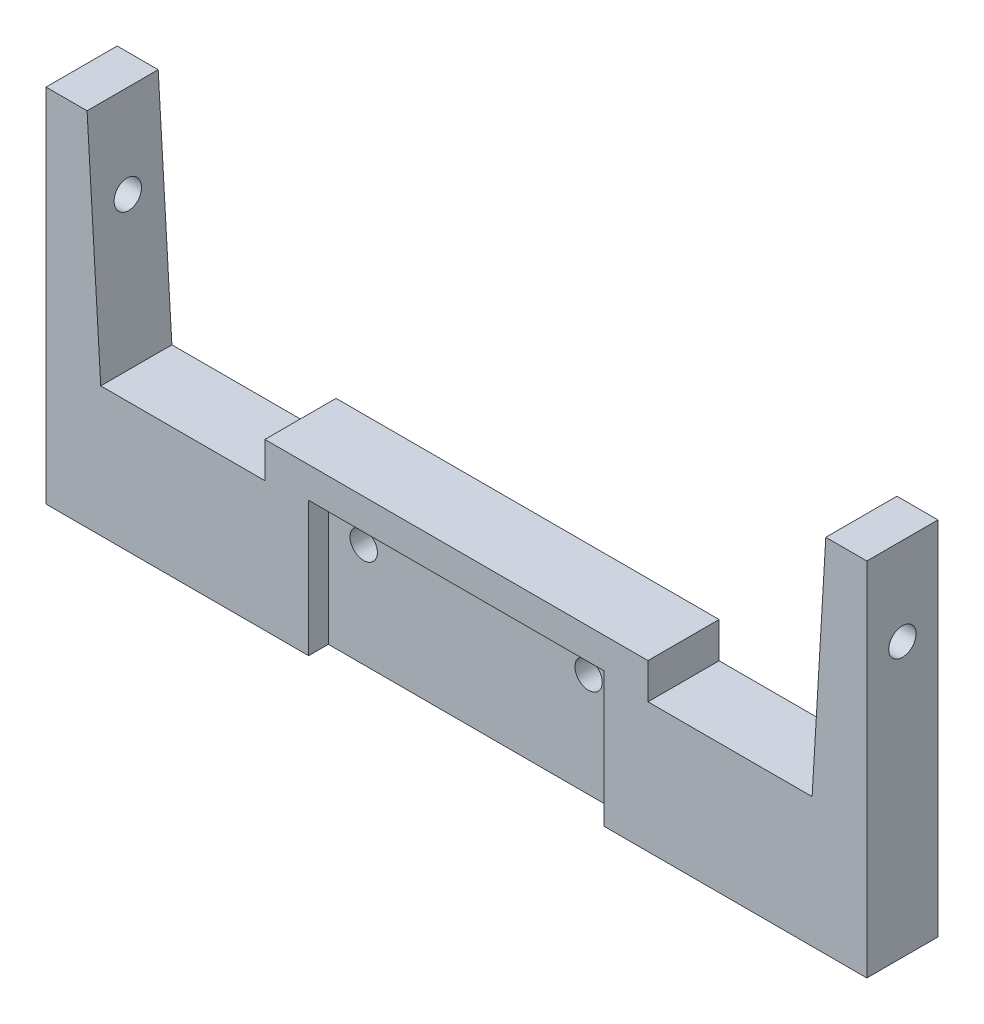
ISO-10303-21;
HEADER;
FILE_DESCRIPTION(('STEP AP214'),'2;1');
FILE_NAME('part.step','',(''),(''),'','','');
FILE_SCHEMA(('AUTOMOTIVE_DESIGN { 1 0 10303 214 1 1 1 1 }'));
ENDSEC;
DATA;
#1=APPLICATION_CONTEXT('core data for automotive mechanical design processes');
#2=APPLICATION_PROTOCOL_DEFINITION('international standard','automotive_design',2000,#1);
#3=PRODUCT_CONTEXT('',#1,'mechanical');
#4=PRODUCT('Part','Part','',(#3));
#5=PRODUCT_RELATED_PRODUCT_CATEGORY('part','',(#4));
#6=PRODUCT_DEFINITION_FORMATION('','',#4);
#7=PRODUCT_DEFINITION_CONTEXT('part definition',#1,'design');
#8=PRODUCT_DEFINITION('design','',#6,#7);
#9=PRODUCT_DEFINITION_SHAPE('','',#8);
#10=(LENGTH_UNIT() NAMED_UNIT(*) SI_UNIT(.MILLI.,.METRE.));
#11=(NAMED_UNIT(*) PLANE_ANGLE_UNIT() SI_UNIT($,.RADIAN.));
#12=(NAMED_UNIT(*) SI_UNIT($,.STERADIAN.) SOLID_ANGLE_UNIT());
#13=UNCERTAINTY_MEASURE_WITH_UNIT(LENGTH_MEASURE(1.E-05),#10,'distance_accuracy_value','');
#14=(GEOMETRIC_REPRESENTATION_CONTEXT(3) GLOBAL_UNCERTAINTY_ASSIGNED_CONTEXT((#13)) GLOBAL_UNIT_ASSIGNED_CONTEXT((#10,
#11,#12)) REPRESENTATION_CONTEXT('',''));
#15=CARTESIAN_POINT('',(0.,0.,0.));
#16=DIRECTION('',(0.,0.,1.));
#17=DIRECTION('',(1.,0.,0.));
#18=AXIS2_PLACEMENT_3D('',#15,#16,#17);
#19=CARTESIAN_POINT('',(47.775,9.5,0.));
#20=DIRECTION('',(0.,0.,1.));
#21=DIRECTION('',(1.,0.,0.));
#22=AXIS2_PLACEMENT_3D('',#19,#20,#21);
#23=CYLINDRICAL_SURFACE('',#22,1.25);
#24=CARTESIAN_POINT('',(47.775,9.5,2.5));
#25=DIRECTION('',(0.,0.,-1.));
#26=DIRECTION('',(-1.,0.,0.));
#27=AXIS2_PLACEMENT_3D('',#24,#25,#26);
#28=CIRCLE('',#27,1.25);
#29=CARTESIAN_POINT('',(46.525,9.5,2.5));
#30=VERTEX_POINT('',#29);
#31=EDGE_CURVE('E290',#30,#30,#28,.T.);
#32=ORIENTED_EDGE('',*,*,#31,.T.);
#33=EDGE_LOOP('',(#32));
#34=FACE_BOUND('',#33,.T.);
#35=CARTESIAN_POINT('',(47.775,9.5,4.7));
#36=DIRECTION('',(0.,0.,1.));
#37=DIRECTION('',(1.,0.,0.));
#38=AXIS2_PLACEMENT_3D('',#35,#36,#37);
#39=CIRCLE('',#38,1.25);
#40=CARTESIAN_POINT('',(49.025,9.5,4.7));
#41=VERTEX_POINT('',#40);
#42=EDGE_CURVE('E286',#41,#41,#39,.F.);
#43=ORIENTED_EDGE('',*,*,#42,.F.);
#44=EDGE_LOOP('',(#43));
#45=FACE_BOUND('',#44,.T.);
#46=ADVANCED_FACE('F45',(#34,#45),#23,.F.);
#47=CARTESIAN_POINT('',(27.225,9.5,0.));
#48=DIRECTION('',(0.,0.,1.));
#49=DIRECTION('',(1.,0.,0.));
#50=AXIS2_PLACEMENT_3D('',#47,#48,#49);
#51=CYLINDRICAL_SURFACE('',#50,1.25);
#52=CARTESIAN_POINT('',(27.225,9.5,2.5));
#53=DIRECTION('',(0.,0.,-1.));
#54=DIRECTION('',(-1.,0.,0.));
#55=AXIS2_PLACEMENT_3D('',#52,#53,#54);
#56=CIRCLE('',#55,1.25);
#57=CARTESIAN_POINT('',(25.975,9.5,2.5));
#58=VERTEX_POINT('',#57);
#59=EDGE_CURVE('E377',#58,#58,#56,.T.);
#60=ORIENTED_EDGE('',*,*,#59,.T.);
#61=EDGE_LOOP('',(#60));
#62=FACE_BOUND('',#61,.T.);
#63=CARTESIAN_POINT('',(27.225,9.5,4.7));
#64=DIRECTION('',(0.,0.,1.));
#65=DIRECTION('',(1.,0.,0.));
#66=AXIS2_PLACEMENT_3D('',#63,#64,#65);
#67=CIRCLE('',#66,1.25);
#68=CARTESIAN_POINT('',(28.475,9.5,4.7));
#69=VERTEX_POINT('',#68);
#70=EDGE_CURVE('E280',#69,#69,#67,.F.);
#71=ORIENTED_EDGE('',*,*,#70,.F.);
#72=EDGE_LOOP('',(#71));
#73=FACE_BOUND('',#72,.T.);
#74=ADVANCED_FACE('F550',(#62,#73),#51,.F.);
#75=CARTESIAN_POINT('',(0.,33.,6.5));
#76=DIRECTION('',(1.,0.,0.));
#77=DIRECTION('',(0.,0.,-1.));
#78=AXIS2_PLACEMENT_3D('',#75,#76,#77);
#79=PLANE('',#78);
#80=CARTESIAN_POINT('',(0.,25.,3.25));
#81=DIRECTION('',(-1.,0.,0.));
#82=DIRECTION('',(0.,0.,1.));
#83=AXIS2_PLACEMENT_3D('',#80,#81,#82);
#84=CIRCLE('',#83,1.25);
#85=CARTESIAN_POINT('',(0.,25.,4.5));
#86=VERTEX_POINT('',#85);
#87=EDGE_CURVE('E907',#86,#86,#84,.T.);
#88=ORIENTED_EDGE('',*,*,#87,.F.);
#89=EDGE_LOOP('',(#88));
#90=FACE_BOUND('',#89,.T.);
#91=DIRECTION('',(0.,-1.,0.));
#92=VECTOR('',#91,1.);
#93=CARTESIAN_POINT('',(0.,33.,0.));
#94=LINE('',#93,#92);
#95=CARTESIAN_POINT('',(0.,33.,0.));
#96=VERTEX_POINT('',#95);
#97=CARTESIAN_POINT('',(0.,0.,0.));
#98=VERTEX_POINT('',#97);
#99=EDGE_CURVE('E342',#96,#98,#94,.T.);
#100=ORIENTED_EDGE('',*,*,#99,.T.);
#101=DIRECTION('',(0.,0.,-1.));
#102=VECTOR('',#101,1.);
#103=CARTESIAN_POINT('',(0.,0.,6.5));
#104=LINE('',#103,#102);
#105=CARTESIAN_POINT('',(0.,0.,6.5));
#106=VERTEX_POINT('',#105);
#107=EDGE_CURVE('E11',#106,#98,#104,.T.);
#108=ORIENTED_EDGE('',*,*,#107,.F.);
#109=DIRECTION('',(0.,-1.,0.));
#110=VECTOR('',#109,1.);
#111=CARTESIAN_POINT('',(0.,33.,6.5));
#112=LINE('',#111,#110);
#113=CARTESIAN_POINT('',(0.,33.,6.5));
#114=VERTEX_POINT('',#113);
#115=EDGE_CURVE('E423',#114,#106,#112,.T.);
#116=ORIENTED_EDGE('',*,*,#115,.F.);
#117=DIRECTION('',(0.,0.,-1.));
#118=VECTOR('',#117,1.);
#119=CARTESIAN_POINT('',(0.,33.,6.5));
#120=LINE('',#119,#118);
#121=EDGE_CURVE('E462',#114,#96,#120,.T.);
#122=ORIENTED_EDGE('',*,*,#121,.T.);
#123=EDGE_LOOP('',(#100,#108,#116,#122));
#124=FACE_BOUND('',#123,.T.);
#125=ADVANCED_FACE('F47',(#90,#124),#79,.F.);
#126=CARTESIAN_POINT('',(0.,0.,6.5));
#127=DIRECTION('',(0.,1.,0.));
#128=DIRECTION('',(0.,0.,1.));
#129=AXIS2_PLACEMENT_3D('',#126,#127,#128);
#130=PLANE('',#129);
#131=DIRECTION('',(1.,0.,0.));
#132=VECTOR('',#131,1.);
#133=CARTESIAN_POINT('',(23.9966837443902,0.,4.7));
#134=LINE('',#133,#132);
#135=CARTESIAN_POINT('',(23.9966837443902,0.,4.7));
#136=VERTEX_POINT('',#135);
#137=CARTESIAN_POINT('',(50.9966837443902,0.,4.7));
#138=VERTEX_POINT('',#137);
#139=EDGE_CURVE('E252',#136,#138,#134,.T.);
#140=ORIENTED_EDGE('',*,*,#139,.F.);
#141=DIRECTION('',(0.,0.,1.));
#142=VECTOR('',#141,1.);
#143=CARTESIAN_POINT('',(23.9966837443902,0.,4.7));
#144=LINE('',#143,#142);
#145=CARTESIAN_POINT('',(23.9966837443902,0.,6.5));
#146=VERTEX_POINT('',#145);
#147=EDGE_CURVE('E234',#136,#146,#144,.T.);
#148=ORIENTED_EDGE('',*,*,#147,.T.);
#149=DIRECTION('',(1.,0.,0.));
#150=VECTOR('',#149,1.);
#151=CARTESIAN_POINT('',(0.,0.,6.5));
#152=LINE('',#151,#150);
#153=EDGE_CURVE('E429',#106,#146,#152,.T.);
#154=ORIENTED_EDGE('',*,*,#153,.F.);
#155=ORIENTED_EDGE('',*,*,#107,.T.);
#156=DIRECTION('',(1.,0.,0.));
#157=VECTOR('',#156,1.);
#158=CARTESIAN_POINT('',(0.,0.,0.));
#159=LINE('',#158,#157);
#160=CARTESIAN_POINT('',(75.,0.,0.));
#161=VERTEX_POINT('',#160);
#162=EDGE_CURVE('E466',#98,#161,#159,.T.);
#163=ORIENTED_EDGE('',*,*,#162,.T.);
#164=DIRECTION('',(0.,0.,-1.));
#165=VECTOR('',#164,1.);
#166=CARTESIAN_POINT('',(75.,0.,6.5));
#167=LINE('',#166,#165);
#168=CARTESIAN_POINT('',(75.,0.,6.5));
#169=VERTEX_POINT('',#168);
#170=EDGE_CURVE('E55',#169,#161,#167,.T.);
#171=ORIENTED_EDGE('',*,*,#170,.F.);
#172=CARTESIAN_POINT('',(50.9966837443902,0.,6.5));
#173=VERTEX_POINT('',#172);
#174=EDGE_CURVE('E427',#173,#169,#152,.T.);
#175=ORIENTED_EDGE('',*,*,#174,.F.);
#176=DIRECTION('',(0.,0.,1.));
#177=VECTOR('',#176,1.);
#178=CARTESIAN_POINT('',(50.9966837443902,0.,4.7));
#179=LINE('',#178,#177);
#180=EDGE_CURVE('E63',#138,#173,#179,.T.);
#181=ORIENTED_EDGE('',*,*,#180,.F.);
#182=EDGE_LOOP('',(#140,#148,#154,#155,#163,#171,#175,#181));
#183=FACE_BOUND('',#182,.T.);
#184=ADVANCED_FACE('F257',(#183),#130,.F.);
#185=CARTESIAN_POINT('',(75.,0.,6.5));
#186=DIRECTION('',(-1.,0.,0.));
#187=DIRECTION('',(0.,0.,1.));
#188=AXIS2_PLACEMENT_3D('',#185,#186,#187);
#189=PLANE('',#188);
#190=CARTESIAN_POINT('',(75.,25.,3.25));
#191=DIRECTION('',(-1.,0.,0.));
#192=DIRECTION('',(0.,0.,1.));
#193=AXIS2_PLACEMENT_3D('',#190,#191,#192);
#194=CIRCLE('',#193,1.25);
#195=CARTESIAN_POINT('',(75.,25.,4.5));
#196=VERTEX_POINT('',#195);
#197=EDGE_CURVE('E900',#196,#196,#194,.T.);
#198=ORIENTED_EDGE('',*,*,#197,.T.);
#199=EDGE_LOOP('',(#198));
#200=FACE_BOUND('',#199,.T.);
#201=DIRECTION('',(0.,1.,0.));
#202=VECTOR('',#201,1.);
#203=CARTESIAN_POINT('',(75.,0.,0.));
#204=LINE('',#203,#202);
#205=CARTESIAN_POINT('',(75.,33.,0.));
#206=VERTEX_POINT('',#205);
#207=EDGE_CURVE('E469',#161,#206,#204,.T.);
#208=ORIENTED_EDGE('',*,*,#207,.T.);
#209=DIRECTION('',(0.,0.,-1.));
#210=VECTOR('',#209,1.);
#211=CARTESIAN_POINT('',(75.,33.,6.5));
#212=LINE('',#211,#210);
#213=CARTESIAN_POINT('',(75.,33.,6.5));
#214=VERTEX_POINT('',#213);
#215=EDGE_CURVE('E533',#214,#206,#212,.T.);
#216=ORIENTED_EDGE('',*,*,#215,.F.);
#217=DIRECTION('',(0.,1.,0.));
#218=VECTOR('',#217,1.);
#219=CARTESIAN_POINT('',(75.,0.,6.5));
#220=LINE('',#219,#218);
#221=EDGE_CURVE('E432',#169,#214,#220,.T.);
#222=ORIENTED_EDGE('',*,*,#221,.F.);
#223=ORIENTED_EDGE('',*,*,#170,.T.);
#224=EDGE_LOOP('',(#208,#216,#222,#223));
#225=FACE_BOUND('',#224,.T.);
#226=ADVANCED_FACE('F663',(#200,#225),#189,.F.);
#227=CARTESIAN_POINT('',(75.,33.,6.5));
#228=DIRECTION('',(0.,-1.,0.));
#229=DIRECTION('',(1.,0.,0.));
#230=AXIS2_PLACEMENT_3D('',#227,#228,#229);
#231=PLANE('',#230);
#232=DIRECTION('',(-1.,0.,0.));
#233=VECTOR('',#232,1.);
#234=CARTESIAN_POINT('',(75.,33.,0.));
#235=LINE('',#234,#233);
#236=CARTESIAN_POINT('',(71.25,33.,0.));
#237=VERTEX_POINT('',#236);
#238=EDGE_CURVE('E472',#206,#237,#235,.T.);
#239=ORIENTED_EDGE('',*,*,#238,.T.);
#240=DIRECTION('',(0.,0.,-1.));
#241=VECTOR('',#240,1.);
#242=CARTESIAN_POINT('',(71.25,33.,6.5));
#243=LINE('',#242,#241);
#244=CARTESIAN_POINT('',(71.25,33.,6.5));
#245=VERTEX_POINT('',#244);
#246=EDGE_CURVE('E529',#245,#237,#243,.T.);
#247=ORIENTED_EDGE('',*,*,#246,.F.);
#248=DIRECTION('',(-1.,0.,0.));
#249=VECTOR('',#248,1.);
#250=CARTESIAN_POINT('',(75.,33.,6.5));
#251=LINE('',#250,#249);
#252=EDGE_CURVE('E435',#214,#245,#251,.T.);
#253=ORIENTED_EDGE('',*,*,#252,.F.);
#254=ORIENTED_EDGE('',*,*,#215,.T.);
#255=EDGE_LOOP('',(#239,#247,#253,#254));
#256=FACE_BOUND('',#255,.T.);
#257=ADVANCED_FACE('F659',(#256),#231,.F.);
#258=CARTESIAN_POINT('',(71.25,33.,6.5));
#259=DIRECTION('',(0.998257410369119,-0.0590096826219286,0.));
#260=DIRECTION('',(0.0590096826219286,0.998257410369119,0.));
#261=AXIS2_PLACEMENT_3D('',#258,#259,#260);
#262=PLANE('',#261);
#263=CARTESIAN_POINT('',(70.7770984657145,25.,3.25));
#264=DIRECTION('',(0.998257410369119,-0.0590096826219286,0.));
#265=DIRECTION('',(-0.0590096826219286,-0.998257410369119,0.));
#266=AXIS2_PLACEMENT_3D('',#263,#264,#265);
#267=ELLIPSE('',#266,1.2521820394379,1.25);
#268=CARTESIAN_POINT('',(70.7032076009824,23.75,3.25));
#269=VERTEX_POINT('',#268);
#270=EDGE_CURVE('E271',#269,#269,#267,.T.);
#271=ORIENTED_EDGE('',*,*,#270,.T.);
#272=EDGE_LOOP('',(#271));
#273=FACE_BOUND('',#272,.T.);
#274=DIRECTION('',(-0.0590096826219286,-0.998257410369119,0.));
#275=VECTOR('',#274,1.);
#276=CARTESIAN_POINT('',(71.25,33.,0.));
#277=LINE('',#276,#275);
#278=CARTESIAN_POINT('',(70.,11.8539489196019,0.));
#279=VERTEX_POINT('',#278);
#280=EDGE_CURVE('E475',#237,#279,#277,.T.);
#281=ORIENTED_EDGE('',*,*,#280,.T.);
#282=DIRECTION('',(0.,0.,-1.));
#283=VECTOR('',#282,1.);
#284=CARTESIAN_POINT('',(70.,11.8539489196019,6.5));
#285=LINE('',#284,#283);
#286=CARTESIAN_POINT('',(70.,11.8539489196019,6.5));
#287=VERTEX_POINT('',#286);
#288=EDGE_CURVE('E525',#287,#279,#285,.T.);
#289=ORIENTED_EDGE('',*,*,#288,.F.);
#290=DIRECTION('',(-0.0590096826219286,-0.998257410369119,0.));
#291=VECTOR('',#290,1.);
#292=CARTESIAN_POINT('',(71.25,33.,6.5));
#293=LINE('',#292,#291);
#294=EDGE_CURVE('E438',#245,#287,#293,.T.);
#295=ORIENTED_EDGE('',*,*,#294,.F.);
#296=ORIENTED_EDGE('',*,*,#246,.T.);
#297=EDGE_LOOP('',(#281,#289,#295,#296));
#298=FACE_BOUND('',#297,.T.);
#299=ADVANCED_FACE('F655',(#273,#298),#262,.F.);
#300=CARTESIAN_POINT('',(70.,11.8539489196019,6.5));
#301=DIRECTION('',(0.,-1.,0.));
#302=DIRECTION('',(1.,0.,0.));
#303=AXIS2_PLACEMENT_3D('',#300,#301,#302);
#304=PLANE('',#303);
#305=DIRECTION('',(-1.,0.,0.));
#306=VECTOR('',#305,1.);
#307=CARTESIAN_POINT('',(70.,11.8539489196019,0.));
#308=LINE('',#307,#306);
#309=CARTESIAN_POINT('',(55.,11.8539489196019,0.));
#310=VERTEX_POINT('',#309);
#311=EDGE_CURVE('E478',#279,#310,#308,.T.);
#312=ORIENTED_EDGE('',*,*,#311,.T.);
#313=DIRECTION('',(0.,0.,-1.));
#314=VECTOR('',#313,1.);
#315=CARTESIAN_POINT('',(55.,11.8539489196019,6.5));
#316=LINE('',#315,#314);
#317=CARTESIAN_POINT('',(55.,11.8539489196019,6.5));
#318=VERTEX_POINT('',#317);
#319=EDGE_CURVE('E521',#318,#310,#316,.T.);
#320=ORIENTED_EDGE('',*,*,#319,.F.);
#321=DIRECTION('',(-1.,0.,0.));
#322=VECTOR('',#321,1.);
#323=CARTESIAN_POINT('',(70.,11.8539489196019,6.5));
#324=LINE('',#323,#322);
#325=EDGE_CURVE('E441',#287,#318,#324,.T.);
#326=ORIENTED_EDGE('',*,*,#325,.F.);
#327=ORIENTED_EDGE('',*,*,#288,.T.);
#328=EDGE_LOOP('',(#312,#320,#326,#327));
#329=FACE_BOUND('',#328,.T.);
#330=ADVANCED_FACE('F651',(#329),#304,.F.);
#331=CARTESIAN_POINT('',(55.,11.8539489196019,6.5));
#332=DIRECTION('',(-1.,0.,0.));
#333=DIRECTION('',(0.,0.,1.));
#334=AXIS2_PLACEMENT_3D('',#331,#332,#333);
#335=PLANE('',#334);
#336=DIRECTION('',(0.,1.,0.));
#337=VECTOR('',#336,1.);
#338=CARTESIAN_POINT('',(55.,11.8539489196019,0.));
#339=LINE('',#338,#337);
#340=CARTESIAN_POINT('',(55.,15.1181044555022,0.));
#341=VERTEX_POINT('',#340);
#342=EDGE_CURVE('E481',#310,#341,#339,.T.);
#343=ORIENTED_EDGE('',*,*,#342,.T.);
#344=DIRECTION('',(0.,0.,-1.));
#345=VECTOR('',#344,1.);
#346=CARTESIAN_POINT('',(55.,15.1181044555022,6.5));
#347=LINE('',#346,#345);
#348=CARTESIAN_POINT('',(55.,15.1181044555022,6.5));
#349=VERTEX_POINT('',#348);
#350=EDGE_CURVE('E517',#349,#341,#347,.T.);
#351=ORIENTED_EDGE('',*,*,#350,.F.);
#352=DIRECTION('',(0.,1.,0.));
#353=VECTOR('',#352,1.);
#354=CARTESIAN_POINT('',(55.,11.8539489196019,6.5));
#355=LINE('',#354,#353);
#356=EDGE_CURVE('E444',#318,#349,#355,.T.);
#357=ORIENTED_EDGE('',*,*,#356,.F.);
#358=ORIENTED_EDGE('',*,*,#319,.T.);
#359=EDGE_LOOP('',(#343,#351,#357,#358));
#360=FACE_BOUND('',#359,.T.);
#361=ADVANCED_FACE('F647',(#360),#335,.F.);
#362=CARTESIAN_POINT('',(55.,15.1181044555022,6.5));
#363=DIRECTION('',(0.,-1.,0.));
#364=DIRECTION('',(1.,0.,0.));
#365=AXIS2_PLACEMENT_3D('',#362,#363,#364);
#366=PLANE('',#365);
#367=DIRECTION('',(-1.,0.,0.));
#368=VECTOR('',#367,1.);
#369=CARTESIAN_POINT('',(55.,15.1181044555022,0.));
#370=LINE('',#369,#368);
#371=CARTESIAN_POINT('',(20.,15.1181044555022,0.));
#372=VERTEX_POINT('',#371);
#373=EDGE_CURVE('E484',#341,#372,#370,.T.);
#374=ORIENTED_EDGE('',*,*,#373,.T.);
#375=DIRECTION('',(0.,0.,-1.));
#376=VECTOR('',#375,1.);
#377=CARTESIAN_POINT('',(20.,15.1181044555022,6.5));
#378=LINE('',#377,#376);
#379=CARTESIAN_POINT('',(20.,15.1181044555022,6.5));
#380=VERTEX_POINT('',#379);
#381=EDGE_CURVE('E513',#380,#372,#378,.T.);
#382=ORIENTED_EDGE('',*,*,#381,.F.);
#383=DIRECTION('',(-1.,0.,0.));
#384=VECTOR('',#383,1.);
#385=CARTESIAN_POINT('',(55.,15.1181044555022,6.5));
#386=LINE('',#385,#384);
#387=EDGE_CURVE('E447',#349,#380,#386,.T.);
#388=ORIENTED_EDGE('',*,*,#387,.F.);
#389=ORIENTED_EDGE('',*,*,#350,.T.);
#390=EDGE_LOOP('',(#374,#382,#388,#389));
#391=FACE_BOUND('',#390,.T.);
#392=ADVANCED_FACE('F643',(#391),#366,.F.);
#393=CARTESIAN_POINT('',(20.,15.1181044555022,6.5));
#394=DIRECTION('',(1.,0.,0.));
#395=DIRECTION('',(0.,0.,-1.));
#396=AXIS2_PLACEMENT_3D('',#393,#394,#395);
#397=PLANE('',#396);
#398=DIRECTION('',(0.,-1.,0.));
#399=VECTOR('',#398,1.);
#400=CARTESIAN_POINT('',(20.,15.1181044555022,0.));
#401=LINE('',#400,#399);
#402=CARTESIAN_POINT('',(20.,11.8539489196019,0.));
#403=VERTEX_POINT('',#402);
#404=EDGE_CURVE('E487',#372,#403,#401,.T.);
#405=ORIENTED_EDGE('',*,*,#404,.T.);
#406=DIRECTION('',(0.,0.,-1.));
#407=VECTOR('',#406,1.);
#408=CARTESIAN_POINT('',(20.,11.8539489196019,6.5));
#409=LINE('',#408,#407);
#410=CARTESIAN_POINT('',(20.,11.8539489196019,6.5));
#411=VERTEX_POINT('',#410);
#412=EDGE_CURVE('E509',#411,#403,#409,.T.);
#413=ORIENTED_EDGE('',*,*,#412,.F.);
#414=DIRECTION('',(0.,-1.,0.));
#415=VECTOR('',#414,1.);
#416=CARTESIAN_POINT('',(20.,15.1181044555022,6.5));
#417=LINE('',#416,#415);
#418=EDGE_CURVE('E450',#380,#411,#417,.T.);
#419=ORIENTED_EDGE('',*,*,#418,.F.);
#420=ORIENTED_EDGE('',*,*,#381,.T.);
#421=EDGE_LOOP('',(#405,#413,#419,#420));
#422=FACE_BOUND('',#421,.T.);
#423=ADVANCED_FACE('F639',(#422),#397,.F.);
#424=CARTESIAN_POINT('',(20.,11.8539489196019,6.5));
#425=DIRECTION('',(0.,-1.,0.));
#426=DIRECTION('',(1.,0.,0.));
#427=AXIS2_PLACEMENT_3D('',#424,#425,#426);
#428=PLANE('',#427);
#429=DIRECTION('',(-1.,0.,0.));
#430=VECTOR('',#429,1.);
#431=CARTESIAN_POINT('',(20.,11.8539489196019,0.));
#432=LINE('',#431,#430);
#433=CARTESIAN_POINT('',(5.,11.8539489196019,0.));
#434=VERTEX_POINT('',#433);
#435=EDGE_CURVE('E490',#403,#434,#432,.T.);
#436=ORIENTED_EDGE('',*,*,#435,.T.);
#437=DIRECTION('',(0.,0.,-1.));
#438=VECTOR('',#437,1.);
#439=CARTESIAN_POINT('',(5.,11.8539489196019,6.5));
#440=LINE('',#439,#438);
#441=CARTESIAN_POINT('',(5.,11.8539489196019,6.5));
#442=VERTEX_POINT('',#441);
#443=EDGE_CURVE('E505',#442,#434,#440,.T.);
#444=ORIENTED_EDGE('',*,*,#443,.F.);
#445=DIRECTION('',(-1.,0.,0.));
#446=VECTOR('',#445,1.);
#447=CARTESIAN_POINT('',(20.,11.8539489196019,6.5));
#448=LINE('',#447,#446);
#449=EDGE_CURVE('E453',#411,#442,#448,.T.);
#450=ORIENTED_EDGE('',*,*,#449,.F.);
#451=ORIENTED_EDGE('',*,*,#412,.T.);
#452=EDGE_LOOP('',(#436,#444,#450,#451));
#453=FACE_BOUND('',#452,.T.);
#454=ADVANCED_FACE('F635',(#453),#428,.F.);
#455=CARTESIAN_POINT('',(5.,11.8539489196019,6.5));
#456=DIRECTION('',(-0.998257410369119,-0.0590096826219298,0.));
#457=DIRECTION('',(0.0590096826219298,-0.998257410369119,0.));
#458=AXIS2_PLACEMENT_3D('',#455,#456,#457);
#459=PLANE('',#458);
#460=CARTESIAN_POINT('',(4.22290153428551,25.,3.25));
#461=DIRECTION('',(-0.998257410369119,-0.0590096826219298,0.));
#462=DIRECTION('',(-0.0590096826219298,0.998257410369119,0.));
#463=AXIS2_PLACEMENT_3D('',#460,#461,#462);
#464=ELLIPSE('',#463,1.2521820394379,1.25);
#465=CARTESIAN_POINT('',(4.14901066955339,26.25,3.25));
#466=VERTEX_POINT('',#465);
#467=EDGE_CURVE('E49',#466,#466,#464,.T.);
#468=ORIENTED_EDGE('',*,*,#467,.T.);
#469=EDGE_LOOP('',(#468));
#470=FACE_BOUND('',#469,.T.);
#471=DIRECTION('',(-0.0590096826219298,0.998257410369119,0.));
#472=VECTOR('',#471,1.);
#473=CARTESIAN_POINT('',(5.,11.8539489196019,0.));
#474=LINE('',#473,#472);
#475=CARTESIAN_POINT('',(3.74999999999999,33.,0.));
#476=VERTEX_POINT('',#475);
#477=EDGE_CURVE('E493',#434,#476,#474,.T.);
#478=ORIENTED_EDGE('',*,*,#477,.T.);
#479=DIRECTION('',(0.,0.,-1.));
#480=VECTOR('',#479,1.);
#481=CARTESIAN_POINT('',(3.74999999999999,33.,6.5));
#482=LINE('',#481,#480);
#483=CARTESIAN_POINT('',(3.74999999999999,33.,6.5));
#484=VERTEX_POINT('',#483);
#485=EDGE_CURVE('E501',#484,#476,#482,.T.);
#486=ORIENTED_EDGE('',*,*,#485,.F.);
#487=DIRECTION('',(-0.0590096826219298,0.998257410369119,0.));
#488=VECTOR('',#487,1.);
#489=CARTESIAN_POINT('',(5.,11.8539489196019,6.5));
#490=LINE('',#489,#488);
#491=EDGE_CURVE('E456',#442,#484,#490,.T.);
#492=ORIENTED_EDGE('',*,*,#491,.F.);
#493=ORIENTED_EDGE('',*,*,#443,.T.);
#494=EDGE_LOOP('',(#478,#486,#492,#493));
#495=FACE_BOUND('',#494,.T.);
#496=ADVANCED_FACE('F631',(#470,#495),#459,.F.);
#497=CARTESIAN_POINT('',(3.74999999999999,33.,6.5));
#498=DIRECTION('',(0.,-1.,0.));
#499=DIRECTION('',(0.,0.,-1.));
#500=AXIS2_PLACEMENT_3D('',#497,#498,#499);
#501=PLANE('',#500);
#502=DIRECTION('',(-1.,0.,0.));
#503=VECTOR('',#502,1.);
#504=CARTESIAN_POINT('',(3.74999999999999,33.,0.));
#505=LINE('',#504,#503);
#506=EDGE_CURVE('E428',#476,#96,#505,.T.);
#507=ORIENTED_EDGE('',*,*,#506,.T.);
#508=ORIENTED_EDGE('',*,*,#121,.F.);
#509=DIRECTION('',(-1.,0.,0.));
#510=VECTOR('',#509,1.);
#511=CARTESIAN_POINT('',(3.74999999999999,33.,6.5));
#512=LINE('',#511,#510);
#513=EDGE_CURVE('E459',#484,#114,#512,.T.);
#514=ORIENTED_EDGE('',*,*,#513,.F.);
#515=ORIENTED_EDGE('',*,*,#485,.T.);
#516=EDGE_LOOP('',(#507,#508,#514,#515));
#517=FACE_BOUND('',#516,.T.);
#518=ADVANCED_FACE('F624',(#517),#501,.F.);
#519=CARTESIAN_POINT('',(0.,0.,6.5));
#520=DIRECTION('',(0.,0.,1.));
#521=DIRECTION('',(1.,0.,0.));
#522=AXIS2_PLACEMENT_3D('',#519,#520,#521);
#523=PLANE('',#522);
#524=DIRECTION('',(0.,-1.,0.));
#525=VECTOR('',#524,1.);
#526=CARTESIAN_POINT('',(23.9966837443902,12.3,6.5));
#527=LINE('',#526,#525);
#528=CARTESIAN_POINT('',(23.9966837443902,12.3,6.5));
#529=VERTEX_POINT('',#528);
#530=EDGE_CURVE('E240',#529,#146,#527,.T.);
#531=ORIENTED_EDGE('',*,*,#530,.F.);
#532=DIRECTION('',(-1.,0.,0.));
#533=VECTOR('',#532,1.);
#534=CARTESIAN_POINT('',(23.9966837443902,12.3,6.5));
#535=LINE('',#534,#533);
#536=CARTESIAN_POINT('',(50.9966837443902,12.3,6.5));
#537=VERTEX_POINT('',#536);
#538=EDGE_CURVE('E255',#537,#529,#535,.T.);
#539=ORIENTED_EDGE('',*,*,#538,.F.);
#540=DIRECTION('',(0.,1.,0.));
#541=VECTOR('',#540,1.);
#542=CARTESIAN_POINT('',(50.9966837443902,12.3,6.5));
#543=LINE('',#542,#541);
#544=EDGE_CURVE('E270',#173,#537,#543,.T.);
#545=ORIENTED_EDGE('',*,*,#544,.F.);
#546=ORIENTED_EDGE('',*,*,#174,.T.);
#547=ORIENTED_EDGE('',*,*,#221,.T.);
#548=ORIENTED_EDGE('',*,*,#252,.T.);
#549=ORIENTED_EDGE('',*,*,#294,.T.);
#550=ORIENTED_EDGE('',*,*,#325,.T.);
#551=ORIENTED_EDGE('',*,*,#356,.T.);
#552=ORIENTED_EDGE('',*,*,#387,.T.);
#553=ORIENTED_EDGE('',*,*,#418,.T.);
#554=ORIENTED_EDGE('',*,*,#449,.T.);
#555=ORIENTED_EDGE('',*,*,#491,.T.);
#556=ORIENTED_EDGE('',*,*,#513,.T.);
#557=ORIENTED_EDGE('',*,*,#115,.T.);
#558=ORIENTED_EDGE('',*,*,#153,.T.);
#559=EDGE_LOOP('',(#531,#539,#545,#546,#547,#548,#549,#550,#551,#552,#553,#554,#555,#556,#557,#558));
#560=FACE_BOUND('',#559,.T.);
#561=ADVANCED_FACE('F621',(#560),#523,.T.);
#562=CARTESIAN_POINT('',(0.,0.,0.));
#563=DIRECTION('',(0.,0.,1.));
#564=DIRECTION('',(1.,0.,0.));
#565=AXIS2_PLACEMENT_3D('',#562,#563,#564);
#566=PLANE('',#565);
#567=DIRECTION('',(0.500000000000005,0.866025403784435,0.));
#568=VECTOR('',#567,1.);
#569=CARTESIAN_POINT('',(44.5995735194571,9.50000000000002,0.));
#570=LINE('',#569,#568);
#571=CARTESIAN_POINT('',(44.5995735194571,9.50000000000002,0.));
#572=VERTEX_POINT('',#571);
#573=CARTESIAN_POINT('',(46.1872867597285,12.25,0.));
#574=VERTEX_POINT('',#573);
#575=EDGE_CURVE('E319',#572,#574,#570,.T.);
#576=ORIENTED_EDGE('',*,*,#575,.F.);
#577=DIRECTION('',(-0.499999999999996,0.866025403784441,0.));
#578=VECTOR('',#577,1.);
#579=CARTESIAN_POINT('',(46.1872867597285,6.75000000000001,0.));
#580=LINE('',#579,#578);
#581=CARTESIAN_POINT('',(46.1872867597285,6.75000000000001,0.));
#582=VERTEX_POINT('',#581);
#583=EDGE_CURVE('E71',#582,#572,#580,.T.);
#584=ORIENTED_EDGE('',*,*,#583,.F.);
#585=DIRECTION('',(-1.,0.,0.));
#586=VECTOR('',#585,1.);
#587=CARTESIAN_POINT('',(49.3627132402715,6.75,0.));
#588=LINE('',#587,#586);
#589=CARTESIAN_POINT('',(49.3627132402715,6.75,0.));
#590=VERTEX_POINT('',#589);
#591=EDGE_CURVE('E296',#590,#582,#588,.T.);
#592=ORIENTED_EDGE('',*,*,#591,.F.);
#593=DIRECTION('',(-0.500000000000003,-0.866025403784437,0.));
#594=VECTOR('',#593,1.);
#595=CARTESIAN_POINT('',(50.9504264805429,9.49999999999999,0.));
#596=LINE('',#595,#594);
#597=CARTESIAN_POINT('',(50.9504264805429,9.49999999999999,0.));
#598=VERTEX_POINT('',#597);
#599=EDGE_CURVE('E332',#598,#590,#596,.T.);
#600=ORIENTED_EDGE('',*,*,#599,.F.);
#601=DIRECTION('',(0.499999999999995,-0.866025403784442,0.));
#602=VECTOR('',#601,1.);
#603=CARTESIAN_POINT('',(49.3627132402715,12.25,0.));
#604=LINE('',#603,#602);
#605=CARTESIAN_POINT('',(49.3627132402715,12.25,0.));
#606=VERTEX_POINT('',#605);
#607=EDGE_CURVE('E328',#606,#598,#604,.T.);
#608=ORIENTED_EDGE('',*,*,#607,.F.);
#609=DIRECTION('',(1.,0.,0.));
#610=VECTOR('',#609,1.);
#611=CARTESIAN_POINT('',(46.1872867597285,12.25,0.));
#612=LINE('',#611,#610);
#613=EDGE_CURVE('E324',#574,#606,#612,.T.);
#614=ORIENTED_EDGE('',*,*,#613,.F.);
#615=EDGE_LOOP('',(#576,#584,#592,#600,#608,#614));
#616=FACE_BOUND('',#615,.T.);
#617=DIRECTION('',(0.500000000000012,0.866025403784432,0.));
#618=VECTOR('',#617,1.);
#619=CARTESIAN_POINT('',(24.0495735194571,9.50000000000004,0.));
#620=LINE('',#619,#618);
#621=CARTESIAN_POINT('',(24.0495735194571,9.50000000000004,0.));
#622=VERTEX_POINT('',#621);
#623=CARTESIAN_POINT('',(25.6372867597286,12.25,0.));
#624=VERTEX_POINT('',#623);
#625=EDGE_CURVE('E395',#622,#624,#620,.T.);
#626=ORIENTED_EDGE('',*,*,#625,.F.);
#627=DIRECTION('',(-0.49999999999999,0.866025403784445,0.));
#628=VECTOR('',#627,1.);
#629=CARTESIAN_POINT('',(25.6372867597285,6.75000000000002,0.));
#630=LINE('',#629,#628);
#631=CARTESIAN_POINT('',(25.6372867597285,6.75000000000002,0.));
#632=VERTEX_POINT('',#631);
#633=EDGE_CURVE('E320',#632,#622,#630,.T.);
#634=ORIENTED_EDGE('',*,*,#633,.F.);
#635=DIRECTION('',(-1.,0.,0.));
#636=VECTOR('',#635,1.);
#637=CARTESIAN_POINT('',(28.8127132402714,6.74999999999998,0.));
#638=LINE('',#637,#636);
#639=CARTESIAN_POINT('',(28.8127132402714,6.74999999999998,0.));
#640=VERTEX_POINT('',#639);
#641=EDGE_CURVE('E378',#640,#632,#638,.T.);
#642=ORIENTED_EDGE('',*,*,#641,.F.);
#643=DIRECTION('',(-0.50000000000001,-0.866025403784433,0.));
#644=VECTOR('',#643,1.);
#645=CARTESIAN_POINT('',(30.4004264805429,9.49999999999995,0.));
#646=LINE('',#645,#644);
#647=CARTESIAN_POINT('',(30.4004264805429,9.49999999999995,0.));
#648=VERTEX_POINT('',#647);
#649=EDGE_CURVE('E382',#648,#640,#646,.T.);
#650=ORIENTED_EDGE('',*,*,#649,.F.);
#651=DIRECTION('',(0.49999999999999,-0.866025403784445,0.));
#652=VECTOR('',#651,1.);
#653=CARTESIAN_POINT('',(28.8127132402715,12.25,0.));
#654=LINE('',#653,#652);
#655=CARTESIAN_POINT('',(28.8127132402715,12.25,0.));
#656=VERTEX_POINT('',#655);
#657=EDGE_CURVE('E387',#656,#648,#654,.T.);
#658=ORIENTED_EDGE('',*,*,#657,.F.);
#659=DIRECTION('',(1.,0.,0.));
#660=VECTOR('',#659,1.);
#661=CARTESIAN_POINT('',(25.6372867597286,12.25,0.));
#662=LINE('',#661,#660);
#663=EDGE_CURVE('E391',#624,#656,#662,.T.);
#664=ORIENTED_EDGE('',*,*,#663,.F.);
#665=EDGE_LOOP('',(#626,#634,#642,#650,#658,#664));
#666=FACE_BOUND('',#665,.T.);
#667=ORIENTED_EDGE('',*,*,#99,.F.);
#668=ORIENTED_EDGE('',*,*,#506,.F.);
#669=ORIENTED_EDGE('',*,*,#477,.F.);
#670=ORIENTED_EDGE('',*,*,#435,.F.);
#671=ORIENTED_EDGE('',*,*,#404,.F.);
#672=ORIENTED_EDGE('',*,*,#373,.F.);
#673=ORIENTED_EDGE('',*,*,#342,.F.);
#674=ORIENTED_EDGE('',*,*,#311,.F.);
#675=ORIENTED_EDGE('',*,*,#280,.F.);
#676=ORIENTED_EDGE('',*,*,#238,.F.);
#677=ORIENTED_EDGE('',*,*,#207,.F.);
#678=ORIENTED_EDGE('',*,*,#162,.F.);
#679=EDGE_LOOP('',(#667,#668,#669,#670,#671,#672,#673,#674,#675,#676,#677,#678));
#680=FACE_BOUND('',#679,.T.);
#681=ADVANCED_FACE('F597',(#616,#666,#680),#566,.F.);
#682=CARTESIAN_POINT('',(25.6372867597285,6.75000000000002,2.5));
#683=DIRECTION('',(-0.866025403784445,-0.49999999999999,0.));
#684=DIRECTION('',(0.49999999999999,-0.866025403784445,0.));
#685=AXIS2_PLACEMENT_3D('',#682,#683,#684);
#686=PLANE('',#685);
#687=ORIENTED_EDGE('',*,*,#633,.T.);
#688=DIRECTION('',(0.,0.,-1.));
#689=VECTOR('',#688,1.);
#690=CARTESIAN_POINT('',(24.0495735194571,9.50000000000004,2.5));
#691=LINE('',#690,#689);
#692=CARTESIAN_POINT('',(24.0495735194571,9.50000000000004,2.5));
#693=VERTEX_POINT('',#692);
#694=EDGE_CURVE('E357',#693,#622,#691,.T.);
#695=ORIENTED_EDGE('',*,*,#694,.F.);
#696=DIRECTION('',(-0.49999999999999,0.866025403784445,0.));
#697=VECTOR('',#696,1.);
#698=CARTESIAN_POINT('',(25.6372867597285,6.75000000000002,2.5));
#699=LINE('',#698,#697);
#700=CARTESIAN_POINT('',(25.6372867597285,6.75000000000002,2.5));
#701=VERTEX_POINT('',#700);
#702=EDGE_CURVE('E383',#701,#693,#699,.T.);
#703=ORIENTED_EDGE('',*,*,#702,.F.);
#704=DIRECTION('',(0.,0.,-1.));
#705=VECTOR('',#704,1.);
#706=CARTESIAN_POINT('',(25.6372867597285,6.75000000000002,2.5));
#707=LINE('',#706,#705);
#708=EDGE_CURVE('E374',#701,#632,#707,.T.);
#709=ORIENTED_EDGE('',*,*,#708,.T.);
#710=EDGE_LOOP('',(#687,#695,#703,#709));
#711=FACE_BOUND('',#710,.T.);
#712=ADVANCED_FACE('F593',(#711),#686,.F.);
#713=CARTESIAN_POINT('',(28.8127132402714,6.74999999999998,2.5));
#714=DIRECTION('',(0.,-1.,0.));
#715=DIRECTION('',(1.,0.,0.));
#716=AXIS2_PLACEMENT_3D('',#713,#714,#715);
#717=PLANE('',#716);
#718=ORIENTED_EDGE('',*,*,#641,.T.);
#719=ORIENTED_EDGE('',*,*,#708,.F.);
#720=DIRECTION('',(-1.,0.,0.));
#721=VECTOR('',#720,1.);
#722=CARTESIAN_POINT('',(28.8127132402714,6.74999999999998,2.5));
#723=LINE('',#722,#721);
#724=CARTESIAN_POINT('',(28.8127132402714,6.74999999999998,2.5));
#725=VERTEX_POINT('',#724);
#726=EDGE_CURVE('E361',#725,#701,#723,.T.);
#727=ORIENTED_EDGE('',*,*,#726,.F.);
#728=DIRECTION('',(0.,0.,-1.));
#729=VECTOR('',#728,1.);
#730=CARTESIAN_POINT('',(28.8127132402714,6.74999999999998,2.5));
#731=LINE('',#730,#729);
#732=EDGE_CURVE('E371',#725,#640,#731,.T.);
#733=ORIENTED_EDGE('',*,*,#732,.T.);
#734=EDGE_LOOP('',(#718,#719,#727,#733));
#735=FACE_BOUND('',#734,.T.);
#736=ADVANCED_FACE('F596',(#735),#717,.F.);
#737=CARTESIAN_POINT('',(30.4004264805429,9.49999999999995,2.5));
#738=DIRECTION('',(0.866025403784433,-0.50000000000001,0.));
#739=DIRECTION('',(0.50000000000001,0.866025403784433,0.));
#740=AXIS2_PLACEMENT_3D('',#737,#738,#739);
#741=PLANE('',#740);
#742=ORIENTED_EDGE('',*,*,#649,.T.);
#743=ORIENTED_EDGE('',*,*,#732,.F.);
#744=DIRECTION('',(-0.50000000000001,-0.866025403784433,0.));
#745=VECTOR('',#744,1.);
#746=CARTESIAN_POINT('',(30.4004264805429,9.49999999999995,2.5));
#747=LINE('',#746,#745);
#748=CARTESIAN_POINT('',(30.4004264805429,9.49999999999995,2.5));
#749=VERTEX_POINT('',#748);
#750=EDGE_CURVE('E404',#749,#725,#747,.T.);
#751=ORIENTED_EDGE('',*,*,#750,.F.);
#752=DIRECTION('',(0.,0.,-1.));
#753=VECTOR('',#752,1.);
#754=CARTESIAN_POINT('',(30.4004264805429,9.49999999999995,2.5));
#755=LINE('',#754,#753);
#756=EDGE_CURVE('E368',#749,#648,#755,.T.);
#757=ORIENTED_EDGE('',*,*,#756,.T.);
#758=EDGE_LOOP('',(#742,#743,#751,#757));
#759=FACE_BOUND('',#758,.T.);
#760=ADVANCED_FACE('F610',(#759),#741,.F.);
#761=CARTESIAN_POINT('',(28.8127132402715,12.25,2.5));
#762=DIRECTION('',(0.866025403784445,0.49999999999999,0.));
#763=DIRECTION('',(-0.49999999999999,0.866025403784445,0.));
#764=AXIS2_PLACEMENT_3D('',#761,#762,#763);
#765=PLANE('',#764);
#766=ORIENTED_EDGE('',*,*,#657,.T.);
#767=ORIENTED_EDGE('',*,*,#756,.F.);
#768=DIRECTION('',(0.49999999999999,-0.866025403784445,0.));
#769=VECTOR('',#768,1.);
#770=CARTESIAN_POINT('',(28.8127132402715,12.25,2.5));
#771=LINE('',#770,#769);
#772=CARTESIAN_POINT('',(28.8127132402715,12.25,2.5));
#773=VERTEX_POINT('',#772);
#774=EDGE_CURVE('E408',#773,#749,#771,.T.);
#775=ORIENTED_EDGE('',*,*,#774,.F.);
#776=DIRECTION('',(0.,0.,-1.));
#777=VECTOR('',#776,1.);
#778=CARTESIAN_POINT('',(28.8127132402715,12.25,2.5));
#779=LINE('',#778,#777);
#780=EDGE_CURVE('E365',#773,#656,#779,.T.);
#781=ORIENTED_EDGE('',*,*,#780,.T.);
#782=EDGE_LOOP('',(#766,#767,#775,#781));
#783=FACE_BOUND('',#782,.T.);
#784=ADVANCED_FACE('F606',(#783),#765,.F.);
#785=CARTESIAN_POINT('',(25.6372867597286,12.25,2.5));
#786=DIRECTION('',(0.,1.,0.));
#787=DIRECTION('',(-1.,0.,0.));
#788=AXIS2_PLACEMENT_3D('',#785,#786,#787);
#789=PLANE('',#788);
#790=ORIENTED_EDGE('',*,*,#663,.T.);
#791=ORIENTED_EDGE('',*,*,#780,.F.);
#792=DIRECTION('',(1.,0.,0.));
#793=VECTOR('',#792,1.);
#794=CARTESIAN_POINT('',(25.6372867597286,12.25,2.5));
#795=LINE('',#794,#793);
#796=CARTESIAN_POINT('',(25.6372867597286,12.25,2.5));
#797=VERTEX_POINT('',#796);
#798=EDGE_CURVE('E412',#797,#773,#795,.T.);
#799=ORIENTED_EDGE('',*,*,#798,.F.);
#800=DIRECTION('',(0.,0.,-1.));
#801=VECTOR('',#800,1.);
#802=CARTESIAN_POINT('',(25.6372867597286,12.25,2.5));
#803=LINE('',#802,#801);
#804=EDGE_CURVE('E362',#797,#624,#803,.T.);
#805=ORIENTED_EDGE('',*,*,#804,.T.);
#806=EDGE_LOOP('',(#790,#791,#799,#805));
#807=FACE_BOUND('',#806,.T.);
#808=ADVANCED_FACE('F602',(#807),#789,.F.);
#809=CARTESIAN_POINT('',(24.0495735194571,9.50000000000004,2.5));
#810=DIRECTION('',(-0.866025403784432,0.500000000000012,0.));
#811=DIRECTION('',(-0.500000000000012,-0.866025403784432,0.));
#812=AXIS2_PLACEMENT_3D('',#809,#810,#811);
#813=PLANE('',#812);
#814=ORIENTED_EDGE('',*,*,#625,.T.);
#815=ORIENTED_EDGE('',*,*,#804,.F.);
#816=DIRECTION('',(0.500000000000012,0.866025403784432,0.));
#817=VECTOR('',#816,1.);
#818=CARTESIAN_POINT('',(24.0495735194571,9.50000000000004,2.5));
#819=LINE('',#818,#817);
#820=EDGE_CURVE('E416',#693,#797,#819,.T.);
#821=ORIENTED_EDGE('',*,*,#820,.F.);
#822=ORIENTED_EDGE('',*,*,#694,.T.);
#823=EDGE_LOOP('',(#814,#815,#821,#822));
#824=FACE_BOUND('',#823,.T.);
#825=ADVANCED_FACE('F599',(#824),#813,.F.);
#826=CARTESIAN_POINT('',(0.,0.,2.5));
#827=DIRECTION('',(0.,0.,-1.));
#828=DIRECTION('',(-1.,0.,0.));
#829=AXIS2_PLACEMENT_3D('',#826,#827,#828);
#830=PLANE('',#829);
#831=ORIENTED_EDGE('',*,*,#59,.F.);
#832=EDGE_LOOP('',(#831));
#833=FACE_BOUND('',#832,.T.);
#834=ORIENTED_EDGE('',*,*,#702,.T.);
#835=ORIENTED_EDGE('',*,*,#820,.T.);
#836=ORIENTED_EDGE('',*,*,#798,.T.);
#837=ORIENTED_EDGE('',*,*,#774,.T.);
#838=ORIENTED_EDGE('',*,*,#750,.T.);
#839=ORIENTED_EDGE('',*,*,#726,.T.);
#840=EDGE_LOOP('',(#834,#835,#836,#837,#838,#839));
#841=FACE_BOUND('',#840,.T.);
#842=ADVANCED_FACE('F592',(#833,#841),#830,.T.);
#843=CARTESIAN_POINT('',(46.1872867597285,6.75000000000001,2.5));
#844=DIRECTION('',(-0.866025403784441,-0.499999999999996,0.));
#845=DIRECTION('',(0.499999999999996,-0.866025403784441,0.));
#846=AXIS2_PLACEMENT_3D('',#843,#844,#845);
#847=PLANE('',#846);
#848=ORIENTED_EDGE('',*,*,#583,.T.);
#849=DIRECTION('',(0.,0.,-1.));
#850=VECTOR('',#849,1.);
#851=CARTESIAN_POINT('',(44.5995735194571,9.50000000000002,2.5));
#852=LINE('',#851,#850);
#853=CARTESIAN_POINT('',(44.5995735194571,9.50000000000002,2.5));
#854=VERTEX_POINT('',#853);
#855=EDGE_CURVE('E316',#854,#572,#852,.T.);
#856=ORIENTED_EDGE('',*,*,#855,.F.);
#857=DIRECTION('',(-0.499999999999996,0.866025403784441,0.));
#858=VECTOR('',#857,1.);
#859=CARTESIAN_POINT('',(46.1872867597285,6.75000000000001,2.5));
#860=LINE('',#859,#858);
#861=CARTESIAN_POINT('',(46.1872867597285,6.75000000000001,2.5));
#862=VERTEX_POINT('',#861);
#863=EDGE_CURVE('E291',#862,#854,#860,.T.);
#864=ORIENTED_EDGE('',*,*,#863,.F.);
#865=DIRECTION('',(0.,0.,-1.));
#866=VECTOR('',#865,1.);
#867=CARTESIAN_POINT('',(46.1872867597285,6.75000000000001,2.5));
#868=LINE('',#867,#866);
#869=EDGE_CURVE('E339',#862,#582,#868,.T.);
#870=ORIENTED_EDGE('',*,*,#869,.T.);
#871=EDGE_LOOP('',(#848,#856,#864,#870));
#872=FACE_BOUND('',#871,.T.);
#873=ADVANCED_FACE('F574',(#872),#847,.F.);
#874=CARTESIAN_POINT('',(49.3627132402715,6.75,2.5));
#875=DIRECTION('',(0.,-1.,0.));
#876=DIRECTION('',(1.,0.,0.));
#877=AXIS2_PLACEMENT_3D('',#874,#875,#876);
#878=PLANE('',#877);
#879=ORIENTED_EDGE('',*,*,#591,.T.);
#880=ORIENTED_EDGE('',*,*,#869,.F.);
#881=DIRECTION('',(-1.,0.,0.));
#882=VECTOR('',#881,1.);
#883=CARTESIAN_POINT('',(49.3627132402715,6.75,2.5));
#884=LINE('',#883,#882);
#885=CARTESIAN_POINT('',(49.3627132402715,6.75,2.5));
#886=VERTEX_POINT('',#885);
#887=EDGE_CURVE('E312',#886,#862,#884,.T.);
#888=ORIENTED_EDGE('',*,*,#887,.F.);
#889=DIRECTION('',(0.,0.,-1.));
#890=VECTOR('',#889,1.);
#891=CARTESIAN_POINT('',(49.3627132402715,6.75,2.5));
#892=LINE('',#891,#890);
#893=EDGE_CURVE('E343',#886,#590,#892,.T.);
#894=ORIENTED_EDGE('',*,*,#893,.T.);
#895=EDGE_LOOP('',(#879,#880,#888,#894));
#896=FACE_BOUND('',#895,.T.);
#897=ADVANCED_FACE('F570',(#896),#878,.F.);
#898=CARTESIAN_POINT('',(50.9504264805429,9.49999999999999,2.5));
#899=DIRECTION('',(0.866025403784437,-0.500000000000003,0.));
#900=DIRECTION('',(0.500000000000003,0.866025403784437,0.));
#901=AXIS2_PLACEMENT_3D('',#898,#899,#900);
#902=PLANE('',#901);
#903=ORIENTED_EDGE('',*,*,#599,.T.);
#904=ORIENTED_EDGE('',*,*,#893,.F.);
#905=DIRECTION('',(-0.500000000000003,-0.866025403784437,0.));
#906=VECTOR('',#905,1.);
#907=CARTESIAN_POINT('',(50.9504264805429,9.49999999999999,2.5));
#908=LINE('',#907,#906);
#909=CARTESIAN_POINT('',(50.9504264805429,9.49999999999999,2.5));
#910=VERTEX_POINT('',#909);
#911=EDGE_CURVE('E308',#910,#886,#908,.T.);
#912=ORIENTED_EDGE('',*,*,#911,.F.);
#913=DIRECTION('',(0.,0.,-1.));
#914=VECTOR('',#913,1.);
#915=CARTESIAN_POINT('',(50.9504264805429,9.49999999999999,2.5));
#916=LINE('',#915,#914);
#917=EDGE_CURVE('E346',#910,#598,#916,.T.);
#918=ORIENTED_EDGE('',*,*,#917,.T.);
#919=EDGE_LOOP('',(#903,#904,#912,#918));
#920=FACE_BOUND('',#919,.T.);
#921=ADVANCED_FACE('F573',(#920),#902,.F.);
#922=CARTESIAN_POINT('',(49.3627132402715,12.25,2.5));
#923=DIRECTION('',(0.866025403784442,0.499999999999995,0.));
#924=DIRECTION('',(-0.499999999999995,0.866025403784442,0.));
#925=AXIS2_PLACEMENT_3D('',#922,#923,#924);
#926=PLANE('',#925);
#927=ORIENTED_EDGE('',*,*,#607,.T.);
#928=ORIENTED_EDGE('',*,*,#917,.F.);
#929=DIRECTION('',(0.499999999999995,-0.866025403784442,0.));
#930=VECTOR('',#929,1.);
#931=CARTESIAN_POINT('',(49.3627132402715,12.25,2.5));
#932=LINE('',#931,#930);
#933=CARTESIAN_POINT('',(49.3627132402715,12.25,2.5));
#934=VERTEX_POINT('',#933);
#935=EDGE_CURVE('E304',#934,#910,#932,.T.);
#936=ORIENTED_EDGE('',*,*,#935,.F.);
#937=DIRECTION('',(0.,0.,-1.));
#938=VECTOR('',#937,1.);
#939=CARTESIAN_POINT('',(49.3627132402715,12.25,2.5));
#940=LINE('',#939,#938);
#941=EDGE_CURVE('E349',#934,#606,#940,.T.);
#942=ORIENTED_EDGE('',*,*,#941,.T.);
#943=EDGE_LOOP('',(#927,#928,#936,#942));
#944=FACE_BOUND('',#943,.T.);
#945=ADVANCED_FACE('F578',(#944),#926,.F.);
#946=CARTESIAN_POINT('',(46.1872867597285,12.25,2.5));
#947=DIRECTION('',(0.,1.,0.));
#948=DIRECTION('',(-1.,0.,0.));
#949=AXIS2_PLACEMENT_3D('',#946,#947,#948);
#950=PLANE('',#949);
#951=ORIENTED_EDGE('',*,*,#613,.T.);
#952=ORIENTED_EDGE('',*,*,#941,.F.);
#953=DIRECTION('',(1.,0.,0.));
#954=VECTOR('',#953,1.);
#955=CARTESIAN_POINT('',(46.1872867597285,12.25,2.5));
#956=LINE('',#955,#954);
#957=CARTESIAN_POINT('',(46.1872867597285,12.25,2.5));
#958=VERTEX_POINT('',#957);
#959=EDGE_CURVE('E300',#958,#934,#956,.T.);
#960=ORIENTED_EDGE('',*,*,#959,.F.);
#961=DIRECTION('',(0.,0.,-1.));
#962=VECTOR('',#961,1.);
#963=CARTESIAN_POINT('',(46.1872867597285,12.25,2.5));
#964=LINE('',#963,#962);
#965=EDGE_CURVE('E352',#958,#574,#964,.T.);
#966=ORIENTED_EDGE('',*,*,#965,.T.);
#967=EDGE_LOOP('',(#951,#952,#960,#966));
#968=FACE_BOUND('',#967,.T.);
#969=ADVANCED_FACE('F582',(#968),#950,.F.);
#970=CARTESIAN_POINT('',(44.5995735194571,9.50000000000002,2.5));
#971=DIRECTION('',(-0.866025403784435,0.500000000000005,0.));
#972=DIRECTION('',(-0.500000000000005,-0.866025403784436,0.));
#973=AXIS2_PLACEMENT_3D('',#970,#971,#972);
#974=PLANE('',#973);
#975=ORIENTED_EDGE('',*,*,#575,.T.);
#976=ORIENTED_EDGE('',*,*,#965,.F.);
#977=DIRECTION('',(0.500000000000005,0.866025403784435,0.));
#978=VECTOR('',#977,1.);
#979=CARTESIAN_POINT('',(44.5995735194571,9.50000000000002,2.5));
#980=LINE('',#979,#978);
#981=EDGE_CURVE('E295',#854,#958,#980,.T.);
#982=ORIENTED_EDGE('',*,*,#981,.F.);
#983=ORIENTED_EDGE('',*,*,#855,.T.);
#984=EDGE_LOOP('',(#975,#976,#982,#983));
#985=FACE_BOUND('',#984,.T.);
#986=ADVANCED_FACE('F568',(#985),#974,.F.);
#987=CARTESIAN_POINT('',(0.,0.,2.5));
#988=DIRECTION('',(0.,0.,-1.));
#989=DIRECTION('',(-1.,0.,0.));
#990=AXIS2_PLACEMENT_3D('',#987,#988,#989);
#991=PLANE('',#990);
#992=ORIENTED_EDGE('',*,*,#31,.F.);
#993=EDGE_LOOP('',(#992));
#994=FACE_BOUND('',#993,.T.);
#995=ORIENTED_EDGE('',*,*,#863,.T.);
#996=ORIENTED_EDGE('',*,*,#981,.T.);
#997=ORIENTED_EDGE('',*,*,#959,.T.);
#998=ORIENTED_EDGE('',*,*,#935,.T.);
#999=ORIENTED_EDGE('',*,*,#911,.T.);
#1000=ORIENTED_EDGE('',*,*,#887,.T.);
#1001=EDGE_LOOP('',(#995,#996,#997,#998,#999,#1000));
#1002=FACE_BOUND('',#1001,.T.);
#1003=ADVANCED_FACE('F565',(#994,#1002),#991,.T.);
#1004=CARTESIAN_POINT('',(0.,0.,4.7));
#1005=DIRECTION('',(0.,0.,1.));
#1006=DIRECTION('',(1.,0.,0.));
#1007=AXIS2_PLACEMENT_3D('',#1004,#1005,#1006);
#1008=PLANE('',#1007);
#1009=DIRECTION('',(0.,-1.,0.));
#1010=VECTOR('',#1009,1.);
#1011=CARTESIAN_POINT('',(23.9966837443902,12.3,4.7));
#1012=LINE('',#1011,#1010);
#1013=CARTESIAN_POINT('',(23.9966837443902,12.3,4.7));
#1014=VERTEX_POINT('',#1013);
#1015=EDGE_CURVE('E237',#1014,#136,#1012,.T.);
#1016=ORIENTED_EDGE('',*,*,#1015,.T.);
#1017=ORIENTED_EDGE('',*,*,#139,.T.);
#1018=DIRECTION('',(0.,1.,0.));
#1019=VECTOR('',#1018,1.);
#1020=CARTESIAN_POINT('',(50.9966837443902,12.3,4.7));
#1021=LINE('',#1020,#1019);
#1022=CARTESIAN_POINT('',(50.9966837443902,12.3,4.7));
#1023=VERTEX_POINT('',#1022);
#1024=EDGE_CURVE('E260',#138,#1023,#1021,.T.);
#1025=ORIENTED_EDGE('',*,*,#1024,.T.);
#1026=DIRECTION('',(-1.,0.,0.));
#1027=VECTOR('',#1026,1.);
#1028=CARTESIAN_POINT('',(23.9966837443902,12.3,4.7));
#1029=LINE('',#1028,#1027);
#1030=EDGE_CURVE('E245',#1023,#1014,#1029,.T.);
#1031=ORIENTED_EDGE('',*,*,#1030,.T.);
#1032=EDGE_LOOP('',(#1016,#1017,#1025,#1031));
#1033=FACE_BOUND('',#1032,.T.);
#1034=ORIENTED_EDGE('',*,*,#70,.T.);
#1035=EDGE_LOOP('',(#1034));
#1036=FACE_BOUND('',#1035,.T.);
#1037=ORIENTED_EDGE('',*,*,#42,.T.);
#1038=EDGE_LOOP('',(#1037));
#1039=FACE_BOUND('',#1038,.T.);
#1040=ADVANCED_FACE('F249',(#1033,#1036,#1039),#1008,.T.);
#1041=CARTESIAN_POINT('',(23.9966837443902,12.3,4.7));
#1042=DIRECTION('',(-1.,0.,0.));
#1043=DIRECTION('',(0.,0.,1.));
#1044=AXIS2_PLACEMENT_3D('',#1041,#1042,#1043);
#1045=PLANE('',#1044);
#1046=ORIENTED_EDGE('',*,*,#530,.T.);
#1047=ORIENTED_EDGE('',*,*,#147,.F.);
#1048=ORIENTED_EDGE('',*,*,#1015,.F.);
#1049=DIRECTION('',(0.,0.,1.));
#1050=VECTOR('',#1049,1.);
#1051=CARTESIAN_POINT('',(23.9966837443902,12.3,4.7));
#1052=LINE('',#1051,#1050);
#1053=EDGE_CURVE('E277',#1014,#529,#1052,.T.);
#1054=ORIENTED_EDGE('',*,*,#1053,.T.);
#1055=EDGE_LOOP('',(#1046,#1047,#1048,#1054));
#1056=FACE_BOUND('',#1055,.T.);
#1057=ADVANCED_FACE('F236',(#1056),#1045,.F.);
#1058=CARTESIAN_POINT('',(23.9966837443902,12.3,4.7));
#1059=DIRECTION('',(0.,1.,0.));
#1060=DIRECTION('',(0.,0.,1.));
#1061=AXIS2_PLACEMENT_3D('',#1058,#1059,#1060);
#1062=PLANE('',#1061);
#1063=ORIENTED_EDGE('',*,*,#538,.T.);
#1064=ORIENTED_EDGE('',*,*,#1053,.F.);
#1065=ORIENTED_EDGE('',*,*,#1030,.F.);
#1066=DIRECTION('',(0.,0.,1.));
#1067=VECTOR('',#1066,1.);
#1068=CARTESIAN_POINT('',(50.9966837443902,12.3,4.7));
#1069=LINE('',#1068,#1067);
#1070=EDGE_CURVE('E281',#1023,#537,#1069,.T.);
#1071=ORIENTED_EDGE('',*,*,#1070,.T.);
#1072=EDGE_LOOP('',(#1063,#1064,#1065,#1071));
#1073=FACE_BOUND('',#1072,.T.);
#1074=ADVANCED_FACE('F693',(#1073),#1062,.F.);
#1075=CARTESIAN_POINT('',(50.9966837443902,12.3,4.7));
#1076=DIRECTION('',(1.,0.,0.));
#1077=DIRECTION('',(0.,1.,0.));
#1078=AXIS2_PLACEMENT_3D('',#1075,#1076,#1077);
#1079=PLANE('',#1078);
#1080=ORIENTED_EDGE('',*,*,#544,.T.);
#1081=ORIENTED_EDGE('',*,*,#1070,.F.);
#1082=ORIENTED_EDGE('',*,*,#1024,.F.);
#1083=ORIENTED_EDGE('',*,*,#180,.T.);
#1084=EDGE_LOOP('',(#1080,#1081,#1082,#1083));
#1085=FACE_BOUND('',#1084,.T.);
#1086=ADVANCED_FACE('F700',(#1085),#1079,.F.);
#1087=CARTESIAN_POINT('',(75.,25.,3.25));
#1088=DIRECTION('',(-1.,0.,0.));
#1089=DIRECTION('',(0.,0.,1.));
#1090=AXIS2_PLACEMENT_3D('',#1087,#1088,#1089);
#1091=CYLINDRICAL_SURFACE('',#1090,1.25);
#1092=ORIENTED_EDGE('',*,*,#87,.T.);
#1093=EDGE_LOOP('',(#1092));
#1094=FACE_BOUND('',#1093,.T.);
#1095=ORIENTED_EDGE('',*,*,#467,.F.);
#1096=EDGE_LOOP('',(#1095));
#1097=FACE_BOUND('',#1096,.T.);
#1098=ADVANCED_FACE('F708',(#1094,#1097),#1091,.F.);
#1099=ORIENTED_EDGE('',*,*,#197,.F.);
#1100=EDGE_LOOP('',(#1099));
#1101=FACE_BOUND('',#1100,.T.);
#1102=ORIENTED_EDGE('',*,*,#270,.F.);
#1103=EDGE_LOOP('',(#1102));
#1104=FACE_BOUND('',#1103,.T.);
#1105=ADVANCED_FACE('F737',(#1101,#1104),#1091,.F.);
#1106=CLOSED_SHELL('',(#46,#74,#125,#184,#226,#257,#299,#330,#361,#392,#423,#454,#496,#518,#561,
#681,#712,#736,#760,#784,#808,#825,#842,#873,#897,#921,#945,#969,#986,#1003,#1040,#1057,#1074,
#1086,#1098,#1105));
#1107=MANIFOLD_SOLID_BREP('B2',#1106);
#1108=ADVANCED_BREP_SHAPE_REPRESENTATION('',(#18,#1107),#14);
#1109=SHAPE_DEFINITION_REPRESENTATION(#9,#1108);
ENDSEC;
END-ISO-10303-21;
